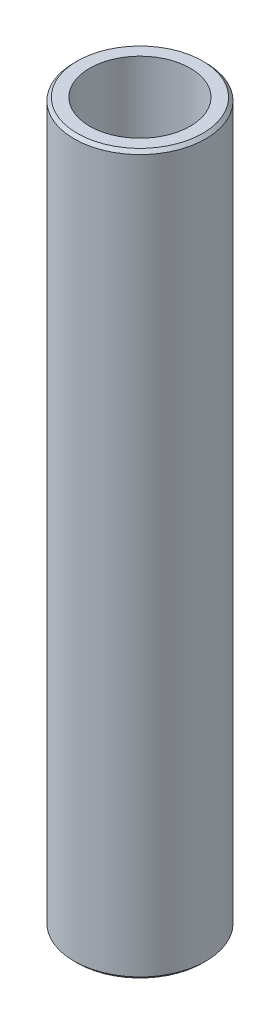
ISO-10303-21;
HEADER;
FILE_DESCRIPTION(('STEP AP214'),'2;1');
FILE_NAME('part.step','',(''),(''),'','','');
FILE_SCHEMA(('AUTOMOTIVE_DESIGN { 1 0 10303 214 1 1 1 1 }'));
ENDSEC;
DATA;
#1=APPLICATION_CONTEXT('core data for automotive mechanical design processes');
#2=APPLICATION_PROTOCOL_DEFINITION('international standard','automotive_design',2000,#1);
#3=PRODUCT_CONTEXT('',#1,'mechanical');
#4=PRODUCT('Part','Part','',(#3));
#5=PRODUCT_RELATED_PRODUCT_CATEGORY('part','',(#4));
#6=PRODUCT_DEFINITION_FORMATION('','',#4);
#7=PRODUCT_DEFINITION_CONTEXT('part definition',#1,'design');
#8=PRODUCT_DEFINITION('design','',#6,#7);
#9=PRODUCT_DEFINITION_SHAPE('','',#8);
#10=(LENGTH_UNIT() NAMED_UNIT(*) SI_UNIT(.MILLI.,.METRE.));
#11=(NAMED_UNIT(*) PLANE_ANGLE_UNIT() SI_UNIT($,.RADIAN.));
#12=(NAMED_UNIT(*) SI_UNIT($,.STERADIAN.) SOLID_ANGLE_UNIT());
#13=UNCERTAINTY_MEASURE_WITH_UNIT(LENGTH_MEASURE(1.E-05),#10,'distance_accuracy_value','');
#14=(GEOMETRIC_REPRESENTATION_CONTEXT(3) GLOBAL_UNCERTAINTY_ASSIGNED_CONTEXT((#13)) GLOBAL_UNIT_ASSIGNED_CONTEXT((#10,
#11,#12)) REPRESENTATION_CONTEXT('',''));
#15=CARTESIAN_POINT('',(0.,0.,0.));
#16=DIRECTION('',(0.,0.,1.));
#17=DIRECTION('',(1.,0.,0.));
#18=AXIS2_PLACEMENT_3D('',#15,#16,#17);
#19=CARTESIAN_POINT('',(0.,600.,0.));
#20=DIRECTION('',(0.,-1.,0.));
#21=DIRECTION('',(0.,0.,-1.));
#22=AXIS2_PLACEMENT_3D('',#19,#20,#21);
#23=CYLINDRICAL_SURFACE('',#22,55.);
#24=CARTESIAN_POINT('',(0.,597.365818459056,0.));
#25=DIRECTION('',(0.,1.,0.));
#26=DIRECTION('',(0.,0.,1.));
#27=AXIS2_PLACEMENT_3D('',#24,#25,#26);
#28=CIRCLE('',#27,55.);
#29=CARTESIAN_POINT('',(0.,597.365818459056,55.));
#30=VERTEX_POINT('',#29);
#31=EDGE_CURVE('E50',#30,#30,#28,.F.);
#32=ORIENTED_EDGE('',*,*,#31,.T.);
#33=EDGE_LOOP('',(#32));
#34=FACE_BOUND('',#33,.T.);
#35=CARTESIAN_POINT('',(0.,2.63418154094408,0.));
#36=DIRECTION('',(0.,1.,0.));
#37=DIRECTION('',(0.,0.,1.));
#38=AXIS2_PLACEMENT_3D('',#35,#36,#37);
#39=CIRCLE('',#38,55.);
#40=CARTESIAN_POINT('',(0.,2.63418154094408,55.));
#41=VERTEX_POINT('',#40);
#42=EDGE_CURVE('E51',#41,#41,#39,.T.);
#43=ORIENTED_EDGE('',*,*,#42,.T.);
#44=EDGE_LOOP('',(#43));
#45=FACE_BOUND('',#44,.T.);
#46=ADVANCED_FACE('F39',(#34,#45),#23,.T.);
#47=CARTESIAN_POINT('',(0.,600.,0.));
#48=DIRECTION('',(0.,1.,0.));
#49=DIRECTION('',(0.,0.,1.));
#50=AXIS2_PLACEMENT_3D('',#47,#48,#49);
#51=PLANE('',#50);
#52=CARTESIAN_POINT('',(0.,600.,0.));
#53=DIRECTION('',(0.,1.,0.));
#54=DIRECTION('',(0.,0.,1.));
#55=AXIS2_PLACEMENT_3D('',#52,#53,#54);
#56=CIRCLE('',#55,52.3658184590556);
#57=CARTESIAN_POINT('',(0.,600.,52.3658184590556));
#58=VERTEX_POINT('',#57);
#59=EDGE_CURVE('E54',#58,#58,#56,.T.);
#60=ORIENTED_EDGE('',*,*,#59,.T.);
#61=EDGE_LOOP('',(#60));
#62=FACE_BOUND('',#61,.T.);
#63=CARTESIAN_POINT('',(0.,600.,0.));
#64=DIRECTION('',(0.,1.,0.));
#65=DIRECTION('',(0.,0.,1.));
#66=AXIS2_PLACEMENT_3D('',#63,#64,#65);
#67=CIRCLE('',#66,41.9921610211089);
#68=CARTESIAN_POINT('',(0.,600.,41.9921610211089));
#69=VERTEX_POINT('',#68);
#70=EDGE_CURVE('E58',#69,#69,#67,.T.);
#71=ORIENTED_EDGE('',*,*,#70,.F.);
#72=EDGE_LOOP('',(#71));
#73=FACE_BOUND('',#72,.T.);
#74=ADVANCED_FACE('F69',(#62,#73),#51,.T.);
#75=CARTESIAN_POINT('',(0.,0.,0.));
#76=DIRECTION('',(0.,1.,0.));
#77=DIRECTION('',(0.,0.,1.));
#78=AXIS2_PLACEMENT_3D('',#75,#76,#77);
#79=PLANE('',#78);
#80=CARTESIAN_POINT('',(0.,0.,0.));
#81=DIRECTION('',(0.,1.,0.));
#82=DIRECTION('',(0.,0.,1.));
#83=AXIS2_PLACEMENT_3D('',#80,#81,#82);
#84=CIRCLE('',#83,52.3658184590559);
#85=CARTESIAN_POINT('',(0.,0.,52.3658184590559));
#86=VERTEX_POINT('',#85);
#87=EDGE_CURVE('E10',#86,#86,#84,.F.);
#88=ORIENTED_EDGE('',*,*,#87,.T.);
#89=EDGE_LOOP('',(#88));
#90=FACE_BOUND('',#89,.T.);
#91=CARTESIAN_POINT('',(0.,0.,0.));
#92=DIRECTION('',(0.,1.,0.));
#93=DIRECTION('',(0.,0.,1.));
#94=AXIS2_PLACEMENT_3D('',#91,#92,#93);
#95=CIRCLE('',#94,41.9921610211089);
#96=CARTESIAN_POINT('',(0.,0.,41.9921610211089));
#97=VERTEX_POINT('',#96);
#98=EDGE_CURVE('E63',#97,#97,#95,.T.);
#99=ORIENTED_EDGE('',*,*,#98,.T.);
#100=EDGE_LOOP('',(#99));
#101=FACE_BOUND('',#100,.T.);
#102=ADVANCED_FACE('F75',(#90,#101),#79,.F.);
#103=CARTESIAN_POINT('',(0.,600.,0.));
#104=DIRECTION('',(0.,-1.,0.));
#105=DIRECTION('',(0.,0.,-1.));
#106=AXIS2_PLACEMENT_3D('',#103,#104,#105);
#107=CYLINDRICAL_SURFACE('',#106,41.9921610211089);
#108=ORIENTED_EDGE('',*,*,#70,.T.);
#109=EDGE_LOOP('',(#108));
#110=FACE_BOUND('',#109,.T.);
#111=ORIENTED_EDGE('',*,*,#98,.F.);
#112=EDGE_LOOP('',(#111));
#113=FACE_BOUND('',#112,.T.);
#114=ADVANCED_FACE('F70',(#110,#113),#107,.F.);
#115=CARTESIAN_POINT('',(0.,600.,0.));
#116=DIRECTION('',(0.,-1.,0.));
#117=DIRECTION('',(0.,0.,-1.));
#118=AXIS2_PLACEMENT_3D('',#115,#116,#117);
#119=CONICAL_SURFACE('',#118,52.3658184590556,0.785398163397469);
#120=ORIENTED_EDGE('',*,*,#31,.F.);
#121=EDGE_LOOP('',(#120));
#122=FACE_BOUND('',#121,.T.);
#123=ORIENTED_EDGE('',*,*,#59,.F.);
#124=EDGE_LOOP('',(#123));
#125=FACE_BOUND('',#124,.T.);
#126=ADVANCED_FACE('F81',(#122,#125),#119,.T.);
#127=CARTESIAN_POINT('',(0.,2.63418154094408,0.));
#128=DIRECTION('',(0.,1.,0.));
#129=DIRECTION('',(0.,0.,1.));
#130=AXIS2_PLACEMENT_3D('',#127,#128,#129);
#131=CONICAL_SURFACE('',#130,55.,0.78539816339746);
#132=ORIENTED_EDGE('',*,*,#87,.F.);
#133=EDGE_LOOP('',(#132));
#134=FACE_BOUND('',#133,.T.);
#135=ORIENTED_EDGE('',*,*,#42,.F.);
#136=EDGE_LOOP('',(#135));
#137=FACE_BOUND('',#136,.T.);
#138=ADVANCED_FACE('F45',(#134,#137),#131,.T.);
#139=CLOSED_SHELL('',(#46,#74,#102,#114,#126,#138));
#140=MANIFOLD_SOLID_BREP('B2',#139);
#141=ADVANCED_BREP_SHAPE_REPRESENTATION('',(#18,#140),#14);
#142=SHAPE_DEFINITION_REPRESENTATION(#9,#141);
ENDSEC;
END-ISO-10303-21;
